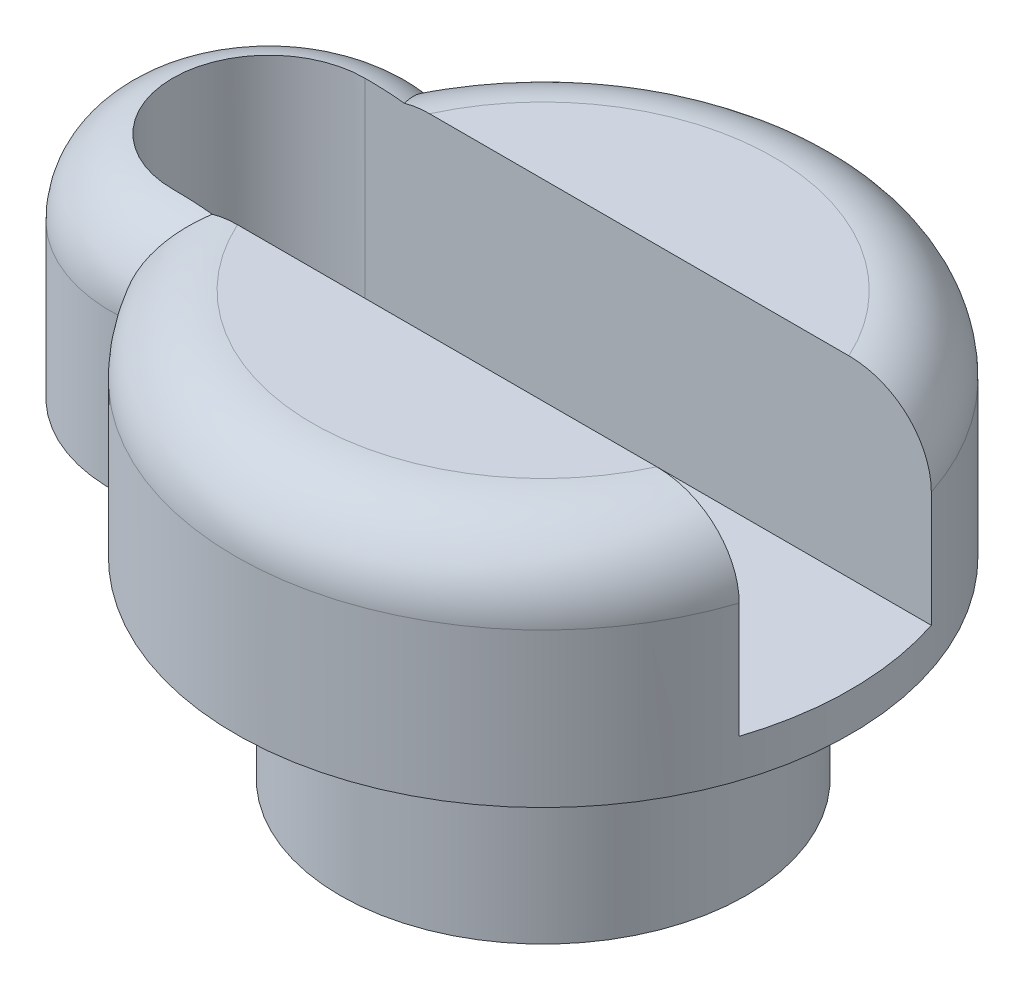
ISO-10303-21;
HEADER;
FILE_DESCRIPTION(('STEP AP214'),'2;1');
FILE_NAME('part.step','',(''),(''),'','','');
FILE_SCHEMA(('AUTOMOTIVE_DESIGN { 1 0 10303 214 1 1 1 1 }'));
ENDSEC;
DATA;
#1=APPLICATION_CONTEXT('core data for automotive mechanical design processes');
#2=APPLICATION_PROTOCOL_DEFINITION('international standard','automotive_design',2000,#1);
#3=PRODUCT_CONTEXT('',#1,'mechanical');
#4=PRODUCT('Part','Part','',(#3));
#5=PRODUCT_RELATED_PRODUCT_CATEGORY('part','',(#4));
#6=PRODUCT_DEFINITION_FORMATION('','',#4);
#7=PRODUCT_DEFINITION_CONTEXT('part definition',#1,'design');
#8=PRODUCT_DEFINITION('design','',#6,#7);
#9=PRODUCT_DEFINITION_SHAPE('','',#8);
#10=(LENGTH_UNIT() NAMED_UNIT(*) SI_UNIT(.MILLI.,.METRE.));
#11=(NAMED_UNIT(*) PLANE_ANGLE_UNIT() SI_UNIT($,.RADIAN.));
#12=(NAMED_UNIT(*) SI_UNIT($,.STERADIAN.) SOLID_ANGLE_UNIT());
#13=UNCERTAINTY_MEASURE_WITH_UNIT(LENGTH_MEASURE(1.E-05),#10,'distance_accuracy_value','');
#14=(GEOMETRIC_REPRESENTATION_CONTEXT(3) GLOBAL_UNCERTAINTY_ASSIGNED_CONTEXT((#13)) GLOBAL_UNIT_ASSIGNED_CONTEXT((#10,
#11,#12)) REPRESENTATION_CONTEXT('',''));
#15=CARTESIAN_POINT('',(0.,0.,0.));
#16=DIRECTION('',(0.,0.,1.));
#17=DIRECTION('',(1.,0.,0.));
#18=AXIS2_PLACEMENT_3D('',#15,#16,#17);
#19=CARTESIAN_POINT('',(0.,6.985,0.));
#20=DIRECTION('',(0.,1.,0.));
#21=DIRECTION('',(0.,0.,1.));
#22=AXIS2_PLACEMENT_3D('',#19,#20,#21);
#23=PLANE('',#22);
#24=DIRECTION('',(1.,0.,0.));
#25=VECTOR('',#24,1.);
#26=CARTESIAN_POINT('',(0.,6.985,-1.5875));
#27=LINE('',#26,#25);
#28=CARTESIAN_POINT('',(-3.46351609639684,6.985,-1.5875));
#29=VERTEX_POINT('',#28);
#30=CARTESIAN_POINT('',(3.46351609639684,6.985,-1.5875));
#31=VERTEX_POINT('',#30);
#32=EDGE_CURVE('E164',#29,#31,#27,.T.);
#33=ORIENTED_EDGE('',*,*,#32,.T.);
#34=CARTESIAN_POINT('',(0.,6.985,0.));
#35=DIRECTION('',(0.,1.,0.));
#36=DIRECTION('',(0.,0.,1.));
#37=AXIS2_PLACEMENT_3D('',#34,#35,#36);
#38=CIRCLE('',#37,3.81);
#39=EDGE_CURVE('E268',#31,#29,#38,.T.);
#40=ORIENTED_EDGE('',*,*,#39,.T.);
#41=EDGE_LOOP('',(#33,#40));
#42=FACE_BOUND('',#41,.T.);
#43=ADVANCED_FACE('F39',(#42),#23,.T.);
#44=CARTESIAN_POINT('',(0.,6.985,0.));
#45=DIRECTION('',(0.,-1.,0.));
#46=DIRECTION('',(0.,0.,-1.));
#47=AXIS2_PLACEMENT_3D('',#44,#45,#46);
#48=CYLINDRICAL_SURFACE('',#47,5.08);
#49=CARTESIAN_POINT('',(0.,3.81,0.));
#50=DIRECTION('',(0.,1.,0.));
#51=DIRECTION('',(0.,0.,1.));
#52=AXIS2_PLACEMENT_3D('',#49,#50,#51);
#53=CIRCLE('',#52,5.08);
#54=CARTESIAN_POINT('',(-4.8349792340776,3.81,-1.5586455036468));
#55=VERTEX_POINT('',#54);
#56=CARTESIAN_POINT('',(-4.8349792340776,3.81,1.5586455036468));
#57=VERTEX_POINT('',#56);
#58=EDGE_CURVE('E153',#55,#57,#53,.T.);
#59=ORIENTED_EDGE('',*,*,#58,.F.);
#60=DIRECTION('',(0.,1.,0.));
#61=VECTOR('',#60,1.);
#62=CARTESIAN_POINT('',(-4.8349792340776,-2.72379220451205,-1.5586455036468));
#63=LINE('',#62,#61);
#64=CARTESIAN_POINT('',(-4.8349792340776,3.175,-1.5586455036468));
#65=VERTEX_POINT('',#64);
#66=EDGE_CURVE('E152',#65,#55,#63,.T.);
#67=ORIENTED_EDGE('',*,*,#66,.F.);
#68=CARTESIAN_POINT('',(0.,3.175,0.));
#69=DIRECTION('',(0.,1.,0.));
#70=DIRECTION('',(0.,0.,1.));
#71=AXIS2_PLACEMENT_3D('',#68,#69,#70);
#72=CIRCLE('',#71,5.08);
#73=CARTESIAN_POINT('',(-4.8349792340776,3.175,1.5586455036468));
#74=VERTEX_POINT('',#73);
#75=EDGE_CURVE('E192',#65,#74,#72,.T.);
#76=ORIENTED_EDGE('',*,*,#75,.T.);
#77=DIRECTION('',(0.,1.,0.));
#78=VECTOR('',#77,1.);
#79=CARTESIAN_POINT('',(-4.8349792340776,-2.72379220451205,1.5586455036468));
#80=LINE('',#79,#78);
#81=EDGE_CURVE('E181',#74,#57,#80,.T.);
#82=ORIENTED_EDGE('',*,*,#81,.T.);
#83=EDGE_LOOP('',(#59,#67,#76,#82));
#84=FACE_BOUND('',#83,.T.);
#85=ADVANCED_FACE('F291',(#84),#48,.T.);
#86=DIRECTION('',(0.,1.,0.));
#87=VECTOR('',#86,1.);
#88=CARTESIAN_POINT('',(-4.36537675030158,-2.72379220451205,-2.59805423883459));
#89=LINE('',#88,#87);
#90=CARTESIAN_POINT('',(-4.36537675030158,3.175,-2.59805423883459));
#91=VERTEX_POINT('',#90);
#92=CARTESIAN_POINT('',(-4.36537675030158,5.715,-2.59805423883459));
#93=VERTEX_POINT('',#92);
#94=EDGE_CURVE('E171',#91,#93,#89,.T.);
#95=ORIENTED_EDGE('',*,*,#94,.T.);
#96=CARTESIAN_POINT('',(0.,5.715,0.));
#97=DIRECTION('',(0.,1.,0.));
#98=DIRECTION('',(0.,0.,1.));
#99=AXIS2_PLACEMENT_3D('',#96,#97,#98);
#100=CIRCLE('',#99,5.08);
#101=CARTESIAN_POINT('',(4.82558221875869,5.715,-1.5875));
#102=VERTEX_POINT('',#101);
#103=EDGE_CURVE('E11',#93,#102,#100,.F.);
#104=ORIENTED_EDGE('',*,*,#103,.T.);
#105=DIRECTION('',(0.,1.,0.));
#106=VECTOR('',#105,1.);
#107=CARTESIAN_POINT('',(4.82558221875869,3.81,-1.5875));
#108=LINE('',#107,#106);
#109=CARTESIAN_POINT('',(4.82558221875869,3.81,-1.5875));
#110=VERTEX_POINT('',#109);
#111=EDGE_CURVE('E169',#110,#102,#108,.T.);
#112=ORIENTED_EDGE('',*,*,#111,.F.);
#113=CARTESIAN_POINT('',(0.,3.81,0.));
#114=DIRECTION('',(0.,1.,0.));
#115=DIRECTION('',(0.,0.,1.));
#116=AXIS2_PLACEMENT_3D('',#113,#114,#115);
#117=CIRCLE('',#116,5.08);
#118=CARTESIAN_POINT('',(4.82558221875869,3.81,1.5875));
#119=VERTEX_POINT('',#118);
#120=EDGE_CURVE('E138',#119,#110,#117,.T.);
#121=ORIENTED_EDGE('',*,*,#120,.F.);
#122=DIRECTION('',(0.,1.,0.));
#123=VECTOR('',#122,1.);
#124=CARTESIAN_POINT('',(4.82558221875869,3.81,1.5875));
#125=LINE('',#124,#123);
#126=CARTESIAN_POINT('',(4.82558221875869,5.715,1.5875));
#127=VERTEX_POINT('',#126);
#128=EDGE_CURVE('E172',#119,#127,#125,.T.);
#129=ORIENTED_EDGE('',*,*,#128,.T.);
#130=CARTESIAN_POINT('',(0.,5.715,0.));
#131=DIRECTION('',(0.,1.,0.));
#132=DIRECTION('',(0.,0.,1.));
#133=AXIS2_PLACEMENT_3D('',#130,#131,#132);
#134=CIRCLE('',#133,5.08);
#135=CARTESIAN_POINT('',(-4.36537675030158,5.715,2.59805423883459));
#136=VERTEX_POINT('',#135);
#137=EDGE_CURVE('E52',#127,#136,#134,.F.);
#138=ORIENTED_EDGE('',*,*,#137,.T.);
#139=DIRECTION('',(0.,1.,0.));
#140=VECTOR('',#139,1.);
#141=CARTESIAN_POINT('',(-4.36537675030158,-2.72379220451205,2.59805423883459));
#142=LINE('',#141,#140);
#143=CARTESIAN_POINT('',(-4.36537675030158,3.175,2.59805423883459));
#144=VERTEX_POINT('',#143);
#145=EDGE_CURVE('E184',#144,#136,#142,.T.);
#146=ORIENTED_EDGE('',*,*,#145,.F.);
#147=EDGE_CURVE('E190',#144,#91,#72,.T.);
#148=ORIENTED_EDGE('',*,*,#147,.T.);
#149=EDGE_LOOP('',(#95,#104,#112,#121,#129,#138,#146,#148));
#150=FACE_BOUND('',#149,.T.);
#151=ADVANCED_FACE('F281',(#150),#48,.T.);
#152=CARTESIAN_POINT('',(0.,0.,0.));
#153=DIRECTION('',(0.,1.,0.));
#154=DIRECTION('',(0.,0.,1.));
#155=AXIS2_PLACEMENT_3D('',#152,#153,#154);
#156=PLANE('',#155);
#157=CARTESIAN_POINT('',(0.,0.,0.));
#158=DIRECTION('',(0.,1.,0.));
#159=DIRECTION('',(0.,0.,1.));
#160=AXIS2_PLACEMENT_3D('',#157,#158,#159);
#161=CIRCLE('',#160,3.3528);
#162=CARTESIAN_POINT('',(0.,0.,3.3528));
#163=VERTEX_POINT('',#162);
#164=EDGE_CURVE('E199',#163,#163,#161,.T.);
#165=ORIENTED_EDGE('',*,*,#164,.F.);
#166=EDGE_LOOP('',(#165));
#167=FACE_BOUND('',#166,.T.);
#168=CARTESIAN_POINT('',(0.,0.,0.));
#169=DIRECTION('',(0.,1.,0.));
#170=DIRECTION('',(0.,0.,1.));
#171=AXIS2_PLACEMENT_3D('',#168,#169,#170);
#172=CIRCLE('',#171,2.4638);
#173=CARTESIAN_POINT('',(0.,0.,2.4638));
#174=VERTEX_POINT('',#173);
#175=EDGE_CURVE('E196',#174,#174,#172,.T.);
#176=ORIENTED_EDGE('',*,*,#175,.T.);
#177=EDGE_LOOP('',(#176));
#178=FACE_BOUND('',#177,.T.);
#179=ADVANCED_FACE('F318',(#167,#178),#156,.F.);
#180=CARTESIAN_POINT('',(0.,3.175,0.));
#181=DIRECTION('',(0.,-1.,0.));
#182=DIRECTION('',(0.,0.,-1.));
#183=AXIS2_PLACEMENT_3D('',#180,#181,#182);
#184=CYLINDRICAL_SURFACE('',#183,3.3528);
#185=CARTESIAN_POINT('',(0.,3.175,0.));
#186=DIRECTION('',(0.,1.,0.));
#187=DIRECTION('',(0.,0.,1.));
#188=AXIS2_PLACEMENT_3D('',#185,#186,#187);
#189=CIRCLE('',#188,3.3528);
#190=CARTESIAN_POINT('',(0.,3.175,3.3528));
#191=VERTEX_POINT('',#190);
#192=EDGE_CURVE('E200',#191,#191,#189,.T.);
#193=ORIENTED_EDGE('',*,*,#192,.F.);
#194=EDGE_LOOP('',(#193));
#195=FACE_BOUND('',#194,.T.);
#196=ORIENTED_EDGE('',*,*,#164,.T.);
#197=EDGE_LOOP('',(#196));
#198=FACE_BOUND('',#197,.T.);
#199=ADVANCED_FACE('F313',(#195,#198),#184,.T.);
#200=CARTESIAN_POINT('',(0.,3.175,0.));
#201=DIRECTION('',(0.,-1.,0.));
#202=DIRECTION('',(0.,0.,-1.));
#203=AXIS2_PLACEMENT_3D('',#200,#201,#202);
#204=CYLINDRICAL_SURFACE('',#203,2.4638);
#205=CARTESIAN_POINT('',(0.,3.175,0.));
#206=DIRECTION('',(0.,1.,0.));
#207=DIRECTION('',(0.,0.,1.));
#208=AXIS2_PLACEMENT_3D('',#205,#206,#207);
#209=CIRCLE('',#208,2.4638);
#210=CARTESIAN_POINT('',(0.,3.175,2.4638));
#211=VERTEX_POINT('',#210);
#212=EDGE_CURVE('E193',#211,#211,#209,.T.);
#213=ORIENTED_EDGE('',*,*,#212,.T.);
#214=EDGE_LOOP('',(#213));
#215=FACE_BOUND('',#214,.T.);
#216=ORIENTED_EDGE('',*,*,#175,.F.);
#217=EDGE_LOOP('',(#216));
#218=FACE_BOUND('',#217,.T.);
#219=ADVANCED_FACE('F308',(#215,#218),#204,.F.);
#220=CARTESIAN_POINT('',(0.,3.175,0.));
#221=DIRECTION('',(0.,1.,0.));
#222=DIRECTION('',(0.,0.,1.));
#223=AXIS2_PLACEMENT_3D('',#220,#221,#222);
#224=PLANE('',#223);
#225=ORIENTED_EDGE('',*,*,#212,.F.);
#226=EDGE_LOOP('',(#225));
#227=FACE_BOUND('',#226,.T.);
#228=ADVANCED_FACE('F302',(#227),#224,.F.);
#229=DIRECTION('',(1.,0.,0.));
#230=VECTOR('',#229,1.);
#231=CARTESIAN_POINT('',(0.,6.985,1.5875));
#232=LINE('',#231,#230);
#233=CARTESIAN_POINT('',(-3.46351609639684,6.985,1.5875));
#234=VERTEX_POINT('',#233);
#235=CARTESIAN_POINT('',(3.46351609639684,6.985,1.5875));
#236=VERTEX_POINT('',#235);
#237=EDGE_CURVE('E146',#234,#236,#232,.T.);
#238=ORIENTED_EDGE('',*,*,#237,.F.);
#239=CARTESIAN_POINT('',(0.,6.985,0.));
#240=DIRECTION('',(0.,1.,0.));
#241=DIRECTION('',(0.,0.,1.));
#242=AXIS2_PLACEMENT_3D('',#239,#240,#241);
#243=CIRCLE('',#242,3.81);
#244=EDGE_CURVE('E253',#234,#236,#243,.T.);
#245=ORIENTED_EDGE('',*,*,#244,.T.);
#246=EDGE_LOOP('',(#238,#245));
#247=FACE_BOUND('',#246,.T.);
#248=ADVANCED_FACE('F274',(#247),#23,.T.);
#249=ORIENTED_EDGE('',*,*,#75,.F.);
#250=CARTESIAN_POINT('',(-4.53368130185499,3.175,0.));
#251=DIRECTION('',(0.,1.,0.));
#252=DIRECTION('',(0.,0.,1.));
#253=AXIS2_PLACEMENT_3D('',#250,#251,#252);
#254=CIRCLE('',#253,1.5875);
#255=EDGE_CURVE('E177',#74,#65,#254,.F.);
#256=ORIENTED_EDGE('',*,*,#255,.F.);
#257=EDGE_LOOP('',(#249,#256));
#258=FACE_BOUND('',#257,.T.);
#259=ORIENTED_EDGE('',*,*,#192,.T.);
#260=EDGE_LOOP('',(#259));
#261=FACE_BOUND('',#260,.T.);
#262=CARTESIAN_POINT('',(-4.53368130185499,3.175,0.));
#263=DIRECTION('',(0.,1.,0.));
#264=DIRECTION('',(0.,0.,1.));
#265=AXIS2_PLACEMENT_3D('',#262,#263,#264);
#266=CIRCLE('',#265,2.6035);
#267=EDGE_CURVE('E179',#144,#91,#266,.F.);
#268=ORIENTED_EDGE('',*,*,#267,.T.);
#269=ORIENTED_EDGE('',*,*,#147,.F.);
#270=EDGE_LOOP('',(#268,#269));
#271=FACE_BOUND('',#270,.T.);
#272=ADVANCED_FACE('F301',(#258,#261,#271),#224,.F.);
#273=CARTESIAN_POINT('',(-4.53368130185499,-2.72379220451205,0.));
#274=DIRECTION('',(0.,1.,0.));
#275=DIRECTION('',(0.,0.,1.));
#276=AXIS2_PLACEMENT_3D('',#273,#274,#275);
#277=CYLINDRICAL_SURFACE('',#276,1.5875);
#278=DIRECTION('',(0.,1.,0.));
#279=VECTOR('',#278,1.);
#280=CARTESIAN_POINT('',(-4.53368130185499,3.81,-1.5875));
#281=LINE('',#280,#279);
#282=CARTESIAN_POINT('',(-4.53368130185499,3.81,-1.5875));
#283=VERTEX_POINT('',#282);
#284=CARTESIAN_POINT('',(-4.53368130185499,6.95934078933385,-1.5875));
#285=VERTEX_POINT('',#284);
#286=EDGE_CURVE('E127',#283,#285,#281,.T.);
#287=ORIENTED_EDGE('',*,*,#286,.T.);
#288=CARTESIAN_POINT('',(-4.53368130185499,6.95934078933386,0.));
#289=DIRECTION('',(0.,1.,0.));
#290=DIRECTION('',(0.,0.,1.));
#291=AXIS2_PLACEMENT_3D('',#288,#289,#290);
#292=CIRCLE('',#291,1.5875);
#293=CARTESIAN_POINT('',(-4.53368130185499,6.95934078933385,1.5875));
#294=VERTEX_POINT('',#293);
#295=EDGE_CURVE('E203',#285,#294,#292,.T.);
#296=ORIENTED_EDGE('',*,*,#295,.T.);
#297=DIRECTION('',(0.,1.,0.));
#298=VECTOR('',#297,1.);
#299=CARTESIAN_POINT('',(-4.53368130185499,3.81,1.5875));
#300=LINE('',#299,#298);
#301=CARTESIAN_POINT('',(-4.53368130185499,3.81,1.5875));
#302=VERTEX_POINT('',#301);
#303=EDGE_CURVE('E137',#302,#294,#300,.T.);
#304=ORIENTED_EDGE('',*,*,#303,.F.);
#305=CARTESIAN_POINT('',(-4.53368130185499,3.81,0.));
#306=DIRECTION('',(0.,1.,0.));
#307=DIRECTION('',(0.,0.,1.));
#308=AXIS2_PLACEMENT_3D('',#305,#306,#307);
#309=CIRCLE('',#308,1.5875);
#310=EDGE_CURVE('E155',#57,#302,#309,.T.);
#311=ORIENTED_EDGE('',*,*,#310,.F.);
#312=ORIENTED_EDGE('',*,*,#81,.F.);
#313=ORIENTED_EDGE('',*,*,#255,.T.);
#314=ORIENTED_EDGE('',*,*,#66,.T.);
#315=EDGE_CURVE('E142',#283,#55,#309,.T.);
#316=ORIENTED_EDGE('',*,*,#315,.F.);
#317=EDGE_LOOP('',(#287,#296,#304,#311,#312,#313,#314,#316));
#318=FACE_BOUND('',#317,.T.);
#319=ADVANCED_FACE('F149',(#318),#277,.F.);
#320=CARTESIAN_POINT('',(-4.53368130185499,-2.72379220451205,0.));
#321=DIRECTION('',(0.,1.,0.));
#322=DIRECTION('',(0.,0.,1.));
#323=AXIS2_PLACEMENT_3D('',#320,#321,#322);
#324=CYLINDRICAL_SURFACE('',#323,2.6035);
#325=ORIENTED_EDGE('',*,*,#145,.T.);
#326=CARTESIAN_POINT('',(-4.53368130185499,5.715,0.));
#327=DIRECTION('',(0.,1.,0.));
#328=DIRECTION('',(0.,0.,1.));
#329=AXIS2_PLACEMENT_3D('',#326,#327,#328);
#330=CIRCLE('',#329,2.6035);
#331=EDGE_CURVE('E237',#136,#93,#330,.F.);
#332=ORIENTED_EDGE('',*,*,#331,.T.);
#333=ORIENTED_EDGE('',*,*,#94,.F.);
#334=ORIENTED_EDGE('',*,*,#267,.F.);
#335=EDGE_LOOP('',(#325,#332,#333,#334));
#336=FACE_BOUND('',#335,.T.);
#337=ADVANCED_FACE('F285',(#336),#324,.T.);
#338=CARTESIAN_POINT('',(0.,3.81,-1.5875));
#339=DIRECTION('',(0.,0.,1.));
#340=DIRECTION('',(1.,0.,0.));
#341=AXIS2_PLACEMENT_3D('',#338,#339,#340);
#342=PLANE('',#341);
#343=CARTESIAN_POINT('',(-3.46351609639684,6.985,-1.5875));
#344=CARTESIAN_POINT('',(-3.50436292904681,6.98499835109791,-1.5875));
#345=CARTESIAN_POINT('',(-3.54519436459593,6.98337017029803,-1.5875));
#346=CARTESIAN_POINT('',(-3.62660550786249,6.97680660331245,-1.5875));
#347=CARTESIAN_POINT('',(-3.66718511186266,6.97186993534326,-1.5875));
#348=CARTESIAN_POINT('',(-3.78841445410829,6.95197716394008,-1.5875));
#349=CARTESIAN_POINT('',(-3.86830094058204,6.9319375821412,-1.5875));
#350=CARTESIAN_POINT('',(-4.02361538311296,6.87828614970619,-1.5875));
#351=CARTESIAN_POINT('',(-4.09902990256799,6.84463555933872,-1.5875));
#352=CARTESIAN_POINT('',(-4.24237889530912,6.76434942285244,-1.5875));
#353=CARTESIAN_POINT('',(-4.31033829020683,6.71775910018592,-1.5875));
#354=CARTESIAN_POINT('',(-4.40228126088642,6.64114999655066,-1.5875));
#355=CARTESIAN_POINT('',(-4.43021093047367,6.6157498318809,-1.5875));
#356=CARTESIAN_POINT('',(-4.48374326965185,6.56260244395275,-1.5875));
#357=CARTESIAN_POINT('',(-4.50934576060876,6.53485504083565,-1.5875));
#358=CARTESIAN_POINT('',(-4.53368130185499,6.50600580467677,-1.5875));
#359=B_SPLINE_CURVE_WITH_KNOTS('',3,(#343,#344,#345,#346,#347,#348,#349,#350,#351,#352,#353,
#354,#355,#356,#357,#358),.UNSPECIFIED.,.F.,.F.,(4,2,2,2,2,2,2,4),(0.,0.122474451390476,
0.244996379631254,0.490792418430554,0.737293022157744,0.982942735745719,1.09607629624818,
1.20921853355124),.UNSPECIFIED.);
#360=CARTESIAN_POINT('',(-3.88085268111467,6.92587483684159,-1.5875));
#361=VERTEX_POINT('',#360);
#362=EDGE_CURVE('E60',#29,#361,#359,.T.);
#363=ORIENTED_EDGE('',*,*,#362,.T.);
#364=CARTESIAN_POINT('',(-3.88085268111467,6.92587483684158,-1.58750000000002));
#365=CARTESIAN_POINT('',(-3.935013865799,6.93237228264304,-1.58750000000001));
#366=CARTESIAN_POINT('',(-3.98930152136189,6.9376485874831,-1.5875));
#367=CARTESIAN_POINT('',(-4.09798912487156,6.94622458353965,-1.5875));
#368=CARTESIAN_POINT('',(-4.15238893794505,6.94952595300719,-1.5875));
#369=CARTESIAN_POINT('',(-4.26123456117558,6.95462635675357,-1.5875));
#370=CARTESIAN_POINT('',(-4.31568034994972,6.95642589155575,-1.5875));
#371=CARTESIAN_POINT('',(-4.4246458746136,6.95876755751968,-1.5875));
#372=CARTESIAN_POINT('',(-4.4791656341305,6.95930862611513,-1.5875));
#373=CARTESIAN_POINT('',(-4.53368130185499,6.95934078933385,-1.5875));
#374=B_SPLINE_CURVE_WITH_KNOTS('',3,(#364,#365,#366,#367,#368,#369,#370,#371,#372,#373),
.UNSPECIFIED.,.F.,.F.,(4,2,2,2,4),(0.,0.163606280207561,0.327073333635278,0.490485885865199,
0.654036362923584),.UNSPECIFIED.);
#375=EDGE_CURVE('E133',#361,#285,#374,.T.);
#376=ORIENTED_EDGE('',*,*,#375,.T.);
#377=ORIENTED_EDGE('',*,*,#286,.F.);
#378=DIRECTION('',(1.,0.,0.));
#379=VECTOR('',#378,1.);
#380=CARTESIAN_POINT('',(0.,3.81,-1.5875));
#381=LINE('',#380,#379);
#382=EDGE_CURVE('E130',#283,#110,#381,.T.);
#383=ORIENTED_EDGE('',*,*,#382,.T.);
#384=ORIENTED_EDGE('',*,*,#111,.T.);
#385=CARTESIAN_POINT('',(4.82558221875869,5.715,-1.5875));
#386=CARTESIAN_POINT('',(4.82558267571095,5.74933477298797,-1.5875));
#387=CARTESIAN_POINT('',(4.82411545113711,5.78365273205524,-1.5875));
#388=CARTESIAN_POINT('',(4.81826684077882,5.85203512121483,-1.5875));
#389=CARTESIAN_POINT('',(4.81388582046466,5.88609958256099,-1.5875));
#390=CARTESIAN_POINT('',(4.79643593955077,5.98740643736862,-1.5875));
#391=CARTESIAN_POINT('',(4.77905998084384,6.05395696259415,-1.5875));
#392=CARTESIAN_POINT('',(4.7334138351964,6.18317080386028,-1.5875));
#393=CARTESIAN_POINT('',(4.70514254134846,6.24583372418994,-1.5875));
#394=CARTESIAN_POINT('',(4.63865035856227,6.36564571369844,-1.5875));
#395=CARTESIAN_POINT('',(4.60042792051345,6.42279392249309,-1.5875));
#396=CARTESIAN_POINT('',(4.51451946365495,6.53108311244743,-1.5875));
#397=CARTESIAN_POINT('',(4.46668095012916,6.5821028543751,-1.5875));
#398=CARTESIAN_POINT('',(4.36346360546502,6.67581695015678,-1.5875));
#399=CARTESIAN_POINT('',(4.30808406340635,6.71851051814788,-1.5875));
#400=CARTESIAN_POINT('',(4.1886311872105,6.79656208923598,-1.5875));
#401=CARTESIAN_POINT('',(4.12427164970767,6.83148124307587,-1.5875));
#402=CARTESIAN_POINT('',(3.99084107455645,6.89079437881489,-1.5875));
#403=CARTESIAN_POINT('',(3.92176695914347,6.91518140755056,-1.5875));
#404=CARTESIAN_POINT('',(3.78807868395027,6.95123350911539,-1.5875));
#405=CARTESIAN_POINT('',(3.72374461052227,6.96395542893966,-1.5875));
#406=CARTESIAN_POINT('',(3.59410223290534,6.98084012412007,-1.5875));
#407=CARTESIAN_POINT('',(3.5287963945175,6.98502174316628,-1.5875));
#408=CARTESIAN_POINT('',(3.46351609639684,6.985,-1.5875));
#409=B_SPLINE_CURVE_WITH_KNOTS('',3,(#385,#386,#387,#388,#389,#390,#391,#392,#393,#394,#395,
#396,#397,#398,#399,#400,#401,#402,#403,#404,#405,#406,#407,#408),.UNSPECIFIED.,.F.,.F.,(4,2,2,
2,2,2,2,2,2,2,2,4),(0.,0.102939775469049,0.205866641887426,0.41114397322845,0.616442165142041,
0.821772335283652,1.03066012457471,1.23956762013255,1.45828948992611,1.67715553695915,
1.87333000891728,2.0690711633321),.UNSPECIFIED.);
#410=EDGE_CURVE('E240',#102,#31,#409,.T.);
#411=ORIENTED_EDGE('',*,*,#410,.T.);
#412=ORIENTED_EDGE('',*,*,#32,.F.);
#413=EDGE_LOOP('',(#363,#376,#377,#383,#384,#411,#412));
#414=FACE_BOUND('',#413,.T.);
#415=ADVANCED_FACE('F129',(#414),#342,.T.);
#416=CARTESIAN_POINT('',(0.,3.81,1.5875));
#417=DIRECTION('',(0.,0.,1.));
#418=DIRECTION('',(1.,0.,0.));
#419=AXIS2_PLACEMENT_3D('',#416,#417,#418);
#420=PLANE('',#419);
#421=ORIENTED_EDGE('',*,*,#237,.T.);
#422=CARTESIAN_POINT('',(3.46351609639684,6.985,1.5875));
#423=CARTESIAN_POINT('',(3.50438994732627,6.98499862683241,1.5875));
#424=CARTESIAN_POINT('',(3.54524882815054,6.98336812735593,1.5875));
#425=CARTESIAN_POINT('',(3.62671307232126,6.97679557361854,1.5875));
#426=CARTESIAN_POINT('',(3.66731834002171,6.97185233812683,1.5875));
#427=CARTESIAN_POINT('',(3.78851792300516,6.95195164374158,1.5875));
#428=CARTESIAN_POINT('',(3.86834872869411,6.93192280472908,1.5875));
#429=CARTESIAN_POINT('',(4.02354128707349,6.87831001048717,1.5875));
#430=CARTESIAN_POINT('',(4.09889122809065,6.84469190563668,1.5875));
#431=CARTESIAN_POINT('',(4.24223347716369,6.76445205940348,1.5875));
#432=CARTESIAN_POINT('',(4.3102365295939,6.7178496740004,1.5875));
#433=CARTESIAN_POINT('',(4.4322518367512,6.61617237975524,1.5875));
#434=CARTESIAN_POINT('',(4.48688550756237,6.56184318570165,1.5875));
#435=CARTESIAN_POINT('',(4.58550248362647,6.44419212285872,1.5875));
#436=CARTESIAN_POINT('',(4.62948423023632,6.3808689401718,1.5875));
#437=CARTESIAN_POINT('',(4.70255638059095,6.25155768758794,1.5875));
#438=CARTESIAN_POINT('',(4.7324283785089,6.18600975822395,1.5875));
#439=CARTESIAN_POINT('',(4.78018203168132,6.05073132314294,1.5875));
#440=CARTESIAN_POINT('',(4.79808143400275,5.9810071757782,1.5875));
#441=CARTESIAN_POINT('',(4.8149692627793,5.87802708023672,1.5875));
#442=CARTESIAN_POINT('',(4.81894878387423,5.8455228443278,1.5875));
#443=CARTESIAN_POINT('',(4.82425279777923,5.78035126268347,1.5875));
#444=CARTESIAN_POINT('',(4.82558156419341,5.74768426475445,1.5875));
#445=CARTESIAN_POINT('',(4.82558221875869,5.715,1.5875));
#446=B_SPLINE_CURVE_WITH_KNOTS('',3,(#422,#423,#424,#425,#426,#427,#428,#429,#430,#431,#432,
#433,#434,#435,#436,#437,#438,#439,#440,#441,#442,#443,#444,#445),.UNSPECIFIED.,.F.,.F.,(4,2,2,
2,2,2,2,2,2,2,2,4),(0.,0.122556287494602,0.245156298468135,0.490792854321205,0.737050567209754,
0.982943124061057,1.21288473393514,1.44285996972033,1.65789985333621,1.87262027114232,
1.97077021180864,2.06876178471559),.UNSPECIFIED.);
#447=EDGE_CURVE('E232',#236,#127,#446,.T.);
#448=ORIENTED_EDGE('',*,*,#447,.T.);
#449=ORIENTED_EDGE('',*,*,#128,.F.);
#450=DIRECTION('',(1.,0.,0.));
#451=VECTOR('',#450,1.);
#452=CARTESIAN_POINT('',(0.,3.81,1.5875));
#453=LINE('',#452,#451);
#454=EDGE_CURVE('E158',#302,#119,#453,.T.);
#455=ORIENTED_EDGE('',*,*,#454,.F.);
#456=ORIENTED_EDGE('',*,*,#303,.T.);
#457=CARTESIAN_POINT('',(-4.53368130185499,6.95934078933385,1.5875));
#458=CARTESIAN_POINT('',(-4.4791656341305,6.95930862611513,1.5875));
#459=CARTESIAN_POINT('',(-4.42464587461359,6.95876755751968,1.5875));
#460=CARTESIAN_POINT('',(-4.31568034994972,6.95642589155575,1.5875));
#461=CARTESIAN_POINT('',(-4.26123456117558,6.95462635675357,1.5875));
#462=CARTESIAN_POINT('',(-4.15238893794504,6.94952595300719,1.5875));
#463=CARTESIAN_POINT('',(-4.09798912487156,6.94622458353965,1.5875));
#464=CARTESIAN_POINT('',(-3.98930152136189,6.9376485874831,1.5875));
#465=CARTESIAN_POINT('',(-3.93501386579899,6.93237228264304,1.5875));
#466=CARTESIAN_POINT('',(-3.88085268111466,6.92587483684158,1.5875));
#467=B_SPLINE_CURVE_WITH_KNOTS('',3,(#457,#458,#459,#460,#461,#462,#463,#464,#465,#466),
.UNSPECIFIED.,.F.,.F.,(4,2,2,2,4),(0.,0.163550477058388,0.32696302928831,0.490430082716027,
0.654036362923591),.UNSPECIFIED.);
#468=CARTESIAN_POINT('',(-3.88085268111447,6.92587483684165,1.5875));
#469=VERTEX_POINT('',#468);
#470=EDGE_CURVE('E214',#294,#469,#467,.T.);
#471=ORIENTED_EDGE('',*,*,#470,.T.);
#472=CARTESIAN_POINT('',(-4.53368130185499,6.50600580467677,1.5875));
#473=CARTESIAN_POINT('',(-4.50947085562419,6.5347085167713,1.5875));
#474=CARTESIAN_POINT('',(-4.48400298673758,6.5623217147355,1.5875));
#475=CARTESIAN_POINT('',(-4.43076990133077,6.61521743327154,1.5875));
#476=CARTESIAN_POINT('',(-4.40300553461673,6.64050080872411,1.5875));
#477=CARTESIAN_POINT('',(-4.316837179803,6.71243263937628,1.5875));
#478=CARTESIAN_POINT('',(-4.25532567859412,6.75543594948708,1.5875));
#479=CARTESIAN_POINT('',(-4.12617916544695,6.83065267792031,1.5875));
#480=CARTESIAN_POINT('',(-4.05854982645492,6.86287596465321,1.5875));
#481=CARTESIAN_POINT('',(-3.9189745887231,6.91621001179108,1.5875));
#482=CARTESIAN_POINT('',(-3.84702523418901,6.93731173994929,1.5875));
#483=CARTESIAN_POINT('',(-3.72287250696261,6.96359500406795,1.5875));
#484=CARTESIAN_POINT('',(-3.67125399243865,6.97165800108812,1.5875));
#485=CARTESIAN_POINT('',(-3.56759608380263,6.98235534589361,1.5875));
#486=CARTESIAN_POINT('',(-3.51555820226324,6.9850042914737,1.5875));
#487=CARTESIAN_POINT('',(-3.46351609639684,6.985,1.5875));
#488=B_SPLINE_CURVE_WITH_KNOTS('',3,(#472,#473,#474,#475,#476,#477,#478,#479,#480,#481,#482,
#483,#484,#485,#486,#487),.UNSPECIFIED.,.F.,.F.,(4,2,2,2,2,2,2,4),(0.,0.112571318289053,
0.225101164972678,0.44909959541008,0.672892405123168,0.896866686630846,1.05333249648699,
1.20937587128812),.UNSPECIFIED.);
#489=EDGE_CURVE('E207',#469,#234,#488,.T.);
#490=ORIENTED_EDGE('',*,*,#489,.T.);
#491=EDGE_LOOP('',(#421,#448,#449,#455,#456,#471,#490));
#492=FACE_BOUND('',#491,.T.);
#493=ADVANCED_FACE('F222',(#492),#420,.F.);
#494=CARTESIAN_POINT('',(0.,3.81,0.));
#495=DIRECTION('',(0.,1.,0.));
#496=DIRECTION('',(0.,0.,1.));
#497=AXIS2_PLACEMENT_3D('',#494,#495,#496);
#498=PLANE('',#497);
#499=ORIENTED_EDGE('',*,*,#382,.F.);
#500=ORIENTED_EDGE('',*,*,#315,.T.);
#501=ORIENTED_EDGE('',*,*,#58,.T.);
#502=ORIENTED_EDGE('',*,*,#310,.T.);
#503=ORIENTED_EDGE('',*,*,#454,.T.);
#504=ORIENTED_EDGE('',*,*,#120,.T.);
#505=EDGE_LOOP('',(#499,#500,#501,#502,#503,#504));
#506=FACE_BOUND('',#505,.T.);
#507=ADVANCED_FACE('F141',(#506),#498,.T.);
#508=CARTESIAN_POINT('',(0.,5.715,0.));
#509=DIRECTION('',(0.,1.,0.));
#510=DIRECTION('',(0.,0.,1.));
#511=AXIS2_PLACEMENT_3D('',#508,#509,#510);
#512=TOROIDAL_SURFACE('',#511,3.81,1.27);
#513=ORIENTED_EDGE('',*,*,#410,.F.);
#514=ORIENTED_EDGE('',*,*,#103,.F.);
#515=CARTESIAN_POINT('',(-3.67164580835973,6.985,-1.01740702668814));
#516=CARTESIAN_POINT('',(-3.67237975431525,6.98500000700137,-1.01978995140764));
#517=CARTESIAN_POINT('',(-3.67311554077747,6.98499787425898,-1.02217234900823));
#518=CARTESIAN_POINT('',(-3.69433434147686,6.98487408737989,-1.09069107194818));
#519=CARTESIAN_POINT('',(-3.71622392658309,6.98308125575118,-1.15641710193362));
#520=CARTESIAN_POINT('',(-3.76222863221431,6.9748378785892,-1.2867990816127));
#521=CARTESIAN_POINT('',(-3.78634365313077,6.9683875414336,-1.35145507904743));
#522=CARTESIAN_POINT('',(-3.8361724894052,6.949644652318,-1.47930271480746));
#523=CARTESIAN_POINT('',(-3.86188582805533,6.93735383511789,-1.54249478211323));
#524=CARTESIAN_POINT('',(-3.91418331572137,6.90592117316743,-1.66673603725106));
#525=CARTESIAN_POINT('',(-3.94076662461235,6.88678577058892,-1.72778718100499));
#526=CARTESIAN_POINT('',(-3.99831953578145,6.83712489489887,-1.85654299333911));
#527=CARTESIAN_POINT('',(-4.02930687133999,6.8052623894808,-1.92373826149075));
#528=CARTESIAN_POINT('',(-4.08993951948699,6.73037457382442,-2.05230766174344));
#529=CARTESIAN_POINT('',(-4.11958542893011,6.68735428665155,-2.11368439632622));
#530=CARTESIAN_POINT('',(-4.17615816382033,6.58962567883963,-2.22893130758044));
#531=CARTESIAN_POINT('',(-4.203059852106,6.53482151595485,-2.28273355435334));
#532=CARTESIAN_POINT('',(-4.25208356853303,6.41457311992117,-2.37968909738348));
#533=CARTESIAN_POINT('',(-4.27420719134545,6.34913244950725,-2.42284594720905));
#534=CARTESIAN_POINT('',(-4.30971654752993,6.21811406983071,-2.49163561205486));
#535=CARTESIAN_POINT('',(-4.32383674437398,6.15351622590809,-2.51875925841206));
#536=CARTESIAN_POINT('',(-4.34618106861437,6.01976755021714,-2.56153802241244));
#537=CARTESIAN_POINT('',(-4.35442119790264,5.95062963870165,-2.57722426811418));
#538=CARTESIAN_POINT('',(-4.36142631452184,5.85315358564211,-2.59054798773433));
#539=CARTESIAN_POINT('',(-4.36290538648814,5.82562337300879,-2.59335911410774));
#540=CARTESIAN_POINT('',(-4.3648810482461,5.77040008975197,-2.59711295297575));
#541=CARTESIAN_POINT('',(-4.3653776689254,5.74270702427593,-2.59805572421025));
#542=CARTESIAN_POINT('',(-4.36537466895792,5.65222366212854,-2.5980508733904));
#543=CARTESIAN_POINT('',(-4.36281847773348,5.58937566698602,-2.59320018207097));
#544=CARTESIAN_POINT('',(-4.35272003937608,5.46549581061148,-2.57398235546509));
#545=CARTESIAN_POINT('',(-4.34516885550076,5.40446740978977,-2.55959816331845));
#546=CARTESIAN_POINT('',(-4.32550511018792,5.28618542876016,-2.52195525779529));
#547=CARTESIAN_POINT('',(-4.31340504360165,5.22892200859049,-2.49872085185657));
#548=CARTESIAN_POINT('',(-4.285254351163,5.11942249563331,-2.44428514567701));
#549=CARTESIAN_POINT('',(-4.26920469579066,5.06718517222914,-2.41308580248416));
#550=CARTESIAN_POINT('',(-4.23322813757841,4.96687580318111,-2.3424946677594));
#551=CARTESIAN_POINT('',(-4.21317776304398,4.91903536936753,-2.30283812188327));
#552=CARTESIAN_POINT('',(-4.17052194901681,4.83052171906617,-2.21740930323201));
#553=CARTESIAN_POINT('',(-4.14791572270656,4.78985071959982,-2.1716351463598));
#554=CARTESIAN_POINT('',(-4.0981947097129,4.71142221156416,-2.06935535378472));
#555=CARTESIAN_POINT('',(-4.07086619552354,4.67462352500054,-2.01222171410163));
#556=CARTESIAN_POINT('',(-4.01531926088602,4.61015021339648,-1.89341947828948));
#557=CARTESIAN_POINT('',(-3.98710014246029,4.5824829496095,-1.83174727215502));
#558=CARTESIAN_POINT('',(-3.93484015580542,4.53894556727973,-1.7141686005408));
#559=CARTESIAN_POINT('',(-3.91077199983626,4.52196123877903,-1.6586777957134));
#560=CARTESIAN_POINT('',(-3.86336493571292,4.49360534158882,-1.54596078464107));
#561=CARTESIAN_POINT('',(-3.84002657581746,4.48223790199207,-1.48873333445568));
#562=CARTESIAN_POINT('',(-3.77191068672703,4.45547243943613,-1.31517725162173));
#563=CARTESIAN_POINT('',(-3.72901445519795,4.44739800874675,-1.19693564503093));
#564=CARTESIAN_POINT('',(-3.68489626644779,4.44518846072702,-1.05986033575753));
#565=CARTESIAN_POINT('',(-3.67932508027783,4.44503820544206,-1.04222391837922));
#566=CARTESIAN_POINT('',(-3.67311556640543,4.44500214552982,-1.02217242834974));
#567=CARTESIAN_POINT('',(-3.67237978236693,4.44500001492559,-1.01979003812581));
#568=CARTESIAN_POINT('',(-3.67164580835973,4.445,-1.01740702668814));
#569=B_SPLINE_CURVE_WITH_KNOTS('',3,(#515,#516,#517,#518,#519,#520,#521,#522,#523,#524,#525,
#526,#527,#528,#529,#530,#531,#532,#533,#534,#535,#536,#537,#538,#539,#540,#541,#542,#543,#544,
#545,#546,#547,#548,#549,#550,#551,#552,#553,#554,#555,#556,#557,#558,#559,#560,#561,#562,#563,
#564,#565,#566,#567,#568),.UNSPECIFIED.,.F.,.F.,(4,2,2,2,2,2,2,2,2,2,2,2,2,2,2,2,2,2,2,2,2,2,2,
2,2,2,4),(0.,0.00748028735519628,0.215184232143868,0.422878884794725,0.630511885773981,
0.837949973133561,1.07875544473909,1.3194526969455,1.5621871376397,1.80484044051418,
2.01805430979388,2.23068570733162,2.31376068777748,2.39683305635745,2.58505171982069,
2.77360804699838,2.96165018844429,3.14964617084542,3.34473740520517,3.53988886266919,
3.75881881958858,3.97792483721615,4.16608937450822,4.35439203046674,4.73086375183786,
4.78635761275462,4.79383790010982),.UNSPECIFIED.);
#570=EDGE_CURVE('E44',#361,#93,#569,.T.);
#571=ORIENTED_EDGE('',*,*,#570,.F.);
#572=ORIENTED_EDGE('',*,*,#362,.F.);
#573=ORIENTED_EDGE('',*,*,#39,.F.);
#574=EDGE_LOOP('',(#513,#514,#571,#572,#573));
#575=FACE_BOUND('',#574,.T.);
#576=ADVANCED_FACE('F41',(#575),#512,.T.);
#577=CARTESIAN_POINT('',(0.,5.715,0.));
#578=DIRECTION('',(0.,1.,0.));
#579=DIRECTION('',(0.,0.,1.));
#580=AXIS2_PLACEMENT_3D('',#577,#578,#579);
#581=TOROIDAL_SURFACE('',#580,3.81,1.27);
#582=ORIENTED_EDGE('',*,*,#244,.F.);
#583=ORIENTED_EDGE('',*,*,#489,.F.);
#584=CARTESIAN_POINT('',(-3.67164580835973,4.445,1.01740702668814));
#585=CARTESIAN_POINT('',(-3.67237975431525,4.44499999299863,1.01978995140764));
#586=CARTESIAN_POINT('',(-3.67311554077747,4.44500212574101,1.02217234900823));
#587=CARTESIAN_POINT('',(-3.69433434147686,4.44512591262011,1.09069107194818));
#588=CARTESIAN_POINT('',(-3.71622392658309,4.44691874424881,1.15641710193361));
#589=CARTESIAN_POINT('',(-3.76222863221431,4.45516212141079,1.2867990816127));
#590=CARTESIAN_POINT('',(-3.78634365313077,4.4616124585664,1.35145507904743));
#591=CARTESIAN_POINT('',(-3.8361724894052,4.480355347682,1.47930271480746));
#592=CARTESIAN_POINT('',(-3.86188582805533,4.49264616488211,1.54249478211323));
#593=CARTESIAN_POINT('',(-3.91418331572137,4.52407882683257,1.66673603725106));
#594=CARTESIAN_POINT('',(-3.94076662461235,4.54321422941107,1.72778718100499));
#595=CARTESIAN_POINT('',(-3.99831953578145,4.59287510510113,1.85654299333911));
#596=CARTESIAN_POINT('',(-4.02930687133998,4.6247376105192,1.92373826149075));
#597=CARTESIAN_POINT('',(-4.08993951948698,4.69962542617558,2.05230766174344));
#598=CARTESIAN_POINT('',(-4.11958542893011,4.74264571334845,2.11368439632622));
#599=CARTESIAN_POINT('',(-4.17615816382033,4.84037432116037,2.22893130758044));
#600=CARTESIAN_POINT('',(-4.203059852106,4.89517848404515,2.28273355435334));
#601=CARTESIAN_POINT('',(-4.25208356853303,5.01542688007882,2.37968909738348));
#602=CARTESIAN_POINT('',(-4.27420719134545,5.08086755049275,2.42284594720905));
#603=CARTESIAN_POINT('',(-4.30971654752993,5.21188593016929,2.49163561205486));
#604=CARTESIAN_POINT('',(-4.32383674437398,5.27648377409191,2.51875925841206));
#605=CARTESIAN_POINT('',(-4.34618106861437,5.41023244978286,2.56153802241244));
#606=CARTESIAN_POINT('',(-4.35442119790264,5.47937036129835,2.57722426811418));
#607=CARTESIAN_POINT('',(-4.36142631452184,5.57684641435789,2.59054798773433));
#608=CARTESIAN_POINT('',(-4.36290538648814,5.60437662699121,2.59335911410774));
#609=CARTESIAN_POINT('',(-4.3648810482461,5.65959991024803,2.59711295297575));
#610=CARTESIAN_POINT('',(-4.3653776689254,5.68729297572407,2.59805572421025));
#611=CARTESIAN_POINT('',(-4.36537466895792,5.77777633787146,2.5980508733904));
#612=CARTESIAN_POINT('',(-4.36281847773348,5.84062433301398,2.59320018207097));
#613=CARTESIAN_POINT('',(-4.35272003937608,5.96450418938852,2.57398235546509));
#614=CARTESIAN_POINT('',(-4.34516885550076,6.02553259021023,2.55959816331845));
#615=CARTESIAN_POINT('',(-4.32550511018792,6.14381457123984,2.52195525779529));
#616=CARTESIAN_POINT('',(-4.31340504360165,6.20107799140951,2.49872085185657));
#617=CARTESIAN_POINT('',(-4.285254351163,6.31057750436668,2.44428514567701));
#618=CARTESIAN_POINT('',(-4.26920469579066,6.36281482777086,2.41308580248416));
#619=CARTESIAN_POINT('',(-4.23322813757841,6.46312419681889,2.3424946677594));
#620=CARTESIAN_POINT('',(-4.21317776304398,6.51096463063246,2.30283812188327));
#621=CARTESIAN_POINT('',(-4.17052194901681,6.59947828093383,2.21740930323201));
#622=CARTESIAN_POINT('',(-4.14791572270656,6.64014928040018,2.1716351463598));
#623=CARTESIAN_POINT('',(-4.0981947097129,6.71857778843584,2.06935535378472));
#624=CARTESIAN_POINT('',(-4.07086619552354,6.75537647499946,2.01222171410163));
#625=CARTESIAN_POINT('',(-4.01531926088602,6.81984978660352,1.89341947828949));
#626=CARTESIAN_POINT('',(-3.98710014246029,6.8475170503905,1.83174727215502));
#627=CARTESIAN_POINT('',(-3.93484015580542,6.89105443272027,1.7141686005408));
#628=CARTESIAN_POINT('',(-3.91077199983626,6.90803876122097,1.6586777957134));
#629=CARTESIAN_POINT('',(-3.86336493571292,6.93639465841118,1.54596078464107));
#630=CARTESIAN_POINT('',(-3.84002657581746,6.94776209800793,1.48873333445568));
#631=CARTESIAN_POINT('',(-3.77191068672703,6.97452756056387,1.31517725162173));
#632=CARTESIAN_POINT('',(-3.72901445519795,6.98260199125325,1.19693564503093));
#633=CARTESIAN_POINT('',(-3.68489626644779,6.98481153927298,1.05986033575753));
#634=CARTESIAN_POINT('',(-3.67932508027783,6.98496179455794,1.04222391837922));
#635=CARTESIAN_POINT('',(-3.67311556640543,6.98499785447018,1.02217242834974));
#636=CARTESIAN_POINT('',(-3.67237978236693,6.98499998507441,1.01979003812581));
#637=CARTESIAN_POINT('',(-3.67164580835973,6.985,1.01740702668814));
#638=B_SPLINE_CURVE_WITH_KNOTS('',3,(#584,#585,#586,#587,#588,#589,#590,#591,#592,#593,#594,
#595,#596,#597,#598,#599,#600,#601,#602,#603,#604,#605,#606,#607,#608,#609,#610,#611,#612,#613,
#614,#615,#616,#617,#618,#619,#620,#621,#622,#623,#624,#625,#626,#627,#628,#629,#630,#631,#632,
#633,#634,#635,#636,#637),.UNSPECIFIED.,.F.,.F.,(4,2,2,2,2,2,2,2,2,2,2,2,2,2,2,2,2,2,2,2,2,2,2,
2,2,2,4),(0.,0.00748028735519628,0.215184232143868,0.422878884794725,0.630511885773981,
0.837949973133561,1.07875544473909,1.3194526969455,1.5621871376397,1.80484044051418,
2.01805430979388,2.23068570733162,2.31376068777748,2.39683305635745,2.58505171982069,
2.77360804699838,2.96165018844429,3.14964617084542,3.34473740520517,3.53988886266919,
3.75881881958858,3.97792483721615,4.16608937450822,4.35439203046674,4.73086375183786,
4.78635761275462,4.79383790010982),.UNSPECIFIED.);
#639=EDGE_CURVE('E261',#136,#469,#638,.T.);
#640=ORIENTED_EDGE('',*,*,#639,.F.);
#641=ORIENTED_EDGE('',*,*,#137,.F.);
#642=ORIENTED_EDGE('',*,*,#447,.F.);
#643=EDGE_LOOP('',(#582,#583,#640,#641,#642));
#644=FACE_BOUND('',#643,.T.);
#645=ADVANCED_FACE('F219',(#644),#581,.T.);
#646=CARTESIAN_POINT('',(-4.53368130185499,5.715,0.));
#647=DIRECTION('',(0.,1.,0.));
#648=DIRECTION('',(0.,0.,1.));
#649=AXIS2_PLACEMENT_3D('',#646,#647,#648);
#650=TOROIDAL_SURFACE('',#649,1.3335,1.27);
#651=ORIENTED_EDGE('',*,*,#570,.T.);
#652=ORIENTED_EDGE('',*,*,#331,.F.);
#653=ORIENTED_EDGE('',*,*,#639,.T.);
#654=ORIENTED_EDGE('',*,*,#470,.F.);
#655=ORIENTED_EDGE('',*,*,#295,.F.);
#656=ORIENTED_EDGE('',*,*,#375,.F.);
#657=EDGE_LOOP('',(#651,#652,#653,#654,#655,#656));
#658=FACE_BOUND('',#657,.T.);
#659=ADVANCED_FACE('F255',(#658),#650,.T.);
#660=CLOSED_SHELL('',(#43,#85,#151,#179,#199,#219,#228,#248,#272,#319,#337,#415,#493,#507,#576,
#645,#659));
#661=MANIFOLD_SOLID_BREP('B2',#660);
#662=ADVANCED_BREP_SHAPE_REPRESENTATION('',(#18,#661),#14);
#663=SHAPE_DEFINITION_REPRESENTATION(#9,#662);
ENDSEC;
END-ISO-10303-21;
